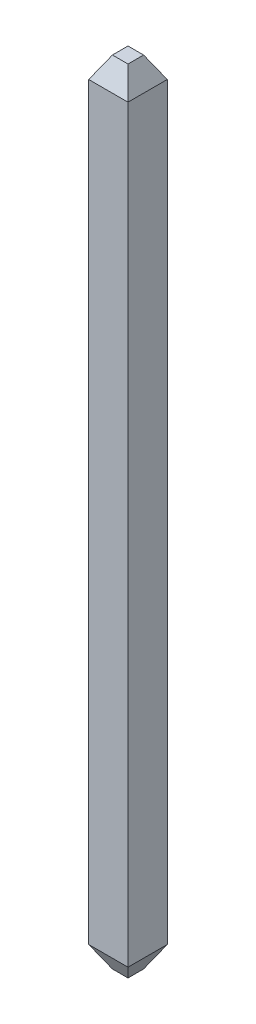
ISO-10303-21;
HEADER;
FILE_DESCRIPTION(('STEP AP214'),'2;1');
FILE_NAME('part.step','',(''),(''),'','','');
FILE_SCHEMA(('AUTOMOTIVE_DESIGN { 1 0 10303 214 1 1 1 1 }'));
ENDSEC;
DATA;
#1=APPLICATION_CONTEXT('core data for automotive mechanical design processes');
#2=APPLICATION_PROTOCOL_DEFINITION('international standard','automotive_design',2000,#1);
#3=PRODUCT_CONTEXT('',#1,'mechanical');
#4=PRODUCT('Part','Part','',(#3));
#5=PRODUCT_RELATED_PRODUCT_CATEGORY('part','',(#4));
#6=PRODUCT_DEFINITION_FORMATION('','',#4);
#7=PRODUCT_DEFINITION_CONTEXT('part definition',#1,'design');
#8=PRODUCT_DEFINITION('design','',#6,#7);
#9=PRODUCT_DEFINITION_SHAPE('','',#8);
#10=(LENGTH_UNIT() NAMED_UNIT(*) SI_UNIT(.MILLI.,.METRE.));
#11=(NAMED_UNIT(*) PLANE_ANGLE_UNIT() SI_UNIT($,.RADIAN.));
#12=(NAMED_UNIT(*) SI_UNIT($,.STERADIAN.) SOLID_ANGLE_UNIT());
#13=UNCERTAINTY_MEASURE_WITH_UNIT(LENGTH_MEASURE(1.E-05),#10,'distance_accuracy_value','');
#14=(GEOMETRIC_REPRESENTATION_CONTEXT(3) GLOBAL_UNCERTAINTY_ASSIGNED_CONTEXT((#13)) GLOBAL_UNIT_ASSIGNED_CONTEXT((#10,
#11,#12)) REPRESENTATION_CONTEXT('',''));
#15=CARTESIAN_POINT('',(0.,0.,0.));
#16=DIRECTION('',(0.,0.,1.));
#17=DIRECTION('',(1.,0.,0.));
#18=AXIS2_PLACEMENT_3D('',#15,#16,#17);
#19=CARTESIAN_POINT('',(0.497289871213,-21.22226807941,4.789039407632));
#20=DIRECTION('',(0.,0.488489958076213,0.87256951634738));
#21=DIRECTION('',(0.,-0.87256951634738,0.488489958076213));
#22=AXIS2_PLACEMENT_3D('',#19,#20,#21);
#23=PLANE('',#22);
#24=DIRECTION('',(1.,0.,0.));
#25=VECTOR('',#24,1.);
#26=CARTESIAN_POINT('',(0.497289871213,-21.57099360271,4.98426616385793));
#27=LINE('',#26,#25);
#28=CARTESIAN_POINT('',(0.48728989589798,-21.5709939289416,4.98426616384538));
#29=VERTEX_POINT('',#28);
#30=CARTESIAN_POINT('',(-0.142710289145667,-21.5709938896675,4.98426632450452));
#31=VERTEX_POINT('',#30);
#32=EDGE_CURVE('E118',#29,#31,#27,.F.);
#33=ORIENTED_EDGE('',*,*,#32,.F.);
#34=DIRECTION('',(0.438284036988266,-0.784297353956641,0.439072617567845));
#35=VECTOR('',#34,1.);
#36=CARTESIAN_POINT('',(0.29728987121219,-21.2309937745705,4.793924307213));
#37=LINE('',#36,#35);
#38=CARTESIAN_POINT('',(0.297289871212797,-21.2309937745703,4.79392430721258));
#39=VERTEX_POINT('',#38);
#40=EDGE_CURVE('E116',#39,#29,#37,.T.);
#41=ORIENTED_EDGE('',*,*,#40,.F.);
#42=DIRECTION('',(-1.,0.,0.));
#43=VECTOR('',#42,1.);
#44=CARTESIAN_POINT('',(0.307289871213,-21.23099377457,4.793924307213));
#45=LINE('',#44,#43);
#46=CARTESIAN_POINT('',(0.0472898712130297,-21.2309937745702,4.79392430721258));
#47=VERTEX_POINT('',#46);
#48=EDGE_CURVE('E79',#47,#39,#45,.F.);
#49=ORIENTED_EDGE('',*,*,#48,.F.);
#50=DIRECTION('',(0.438284036988272,0.784297353956654,-0.439072617567817));
#51=VECTOR('',#50,1.);
#52=CARTESIAN_POINT('',(-0.14271012878781,-21.5709936027095,4.984266163858));
#53=LINE('',#52,#51);
#54=EDGE_CURVE('E110',#31,#47,#53,.T.);
#55=ORIENTED_EDGE('',*,*,#54,.F.);
#56=EDGE_LOOP('',(#33,#41,#49,#55));
#57=FACE_BOUND('',#56,.T.);
#58=ADVANCED_FACE('F17',(#57),#23,.T.);
#59=CARTESIAN_POINT('',(0.497289871213,-33.93541112064,4.789291335356));
#60=DIRECTION('',(0.,-0.487152273933216,0.873317045523387));
#61=DIRECTION('',(0.,-0.873317045523387,-0.487152273933216));
#62=AXIS2_PLACEMENT_3D('',#59,#60,#61);
#63=PLANE('',#62);
#64=DIRECTION('',(-0.438586917260297,-0.784839349958943,-0.437799852403052));
#65=VECTOR('',#64,1.);
#66=CARTESIAN_POINT('',(0.487290184384019,-33.5866775616409,4.983822206765));
#67=LINE('',#66,#65);
#68=CARTESIAN_POINT('',(0.487289980136551,-33.5866774630266,4.98382196176172));
#69=VERTEX_POINT('',#68);
#70=CARTESIAN_POINT('',(0.29728987121302,-33.9266779501895,4.79416285809401));
#71=VERTEX_POINT('',#70);
#72=EDGE_CURVE('E122',#69,#71,#67,.T.);
#73=ORIENTED_EDGE('',*,*,#72,.F.);
#74=DIRECTION('',(1.,0.,0.));
#75=VECTOR('',#74,1.);
#76=CARTESIAN_POINT('',(0.497289871213,-33.5866774970136,4.98382284621967));
#77=LINE('',#76,#75);
#78=CARTESIAN_POINT('',(-0.142710305819022,-33.5866774872793,4.98382196001637));
#79=VERTEX_POINT('',#78);
#80=EDGE_CURVE('E89',#79,#69,#77,.T.);
#81=ORIENTED_EDGE('',*,*,#80,.F.);
#82=DIRECTION('',(-0.438586917260198,0.784839349958761,0.437799852403477));
#83=VECTOR('',#82,1.);
#84=CARTESIAN_POINT('',(0.0472898712136261,-33.9266779501897,4.794162858095));
#85=LINE('',#84,#83);
#86=CARTESIAN_POINT('',(0.0472898712132013,-33.9266779501894,4.79416285809401));
#87=VERTEX_POINT('',#86);
#88=EDGE_CURVE('E84',#87,#79,#85,.T.);
#89=ORIENTED_EDGE('',*,*,#88,.F.);
#90=DIRECTION('',(1.,0.,0.));
#91=VECTOR('',#90,1.);
#92=CARTESIAN_POINT('',(0.03728987121306,-33.92667795019,4.794162858095));
#93=LINE('',#92,#91);
#94=EDGE_CURVE('E20',#71,#87,#93,.F.);
#95=ORIENTED_EDGE('',*,*,#94,.F.);
#96=EDGE_LOOP('',(#73,#81,#89,#95));
#97=FACE_BOUND('',#96,.T.);
#98=ADVANCED_FACE('F86',(#97),#63,.T.);
#99=CARTESIAN_POINT('',(0.03728987121306,-33.92667795019,4.534162858095));
#100=DIRECTION('',(0.,-1.,0.));
#101=DIRECTION('',(1.,0.,0.));
#102=AXIS2_PLACEMENT_3D('',#99,#100,#101);
#103=PLANE('',#102);
#104=DIRECTION('',(0.,0.,1.));
#105=VECTOR('',#104,1.);
#106=CARTESIAN_POINT('',(0.0472898712136262,-33.9266779501897,4.343821001451));
#107=LINE('',#106,#105);
#108=CARTESIAN_POINT('',(0.0472898712133431,-33.9266779501896,4.54416285809542));
#109=VERTEX_POINT('',#108);
#110=EDGE_CURVE('E93',#109,#87,#107,.T.);
#111=ORIENTED_EDGE('',*,*,#110,.F.);
#112=DIRECTION('',(1.,0.,0.));
#113=VECTOR('',#112,1.);
#114=CARTESIAN_POINT('',(0.497289871213,-33.9266779501891,4.54416285809666));
#115=LINE('',#114,#113);
#116=CARTESIAN_POINT('',(0.29728987121304,-33.9266779501898,4.54416285809542));
#117=VERTEX_POINT('',#116);
#118=EDGE_CURVE('E129',#117,#109,#115,.F.);
#119=ORIENTED_EDGE('',*,*,#118,.F.);
#120=DIRECTION('',(0.,0.,1.));
#121=VECTOR('',#120,1.);
#122=CARTESIAN_POINT('',(0.297289871213079,-33.92667795019,4.343821001451));
#123=LINE('',#122,#121);
#124=EDGE_CURVE('E98',#71,#117,#123,.F.);
#125=ORIENTED_EDGE('',*,*,#124,.F.);
#126=ORIENTED_EDGE('',*,*,#94,.T.);
#127=EDGE_LOOP('',(#111,#119,#125,#126));
#128=FACE_BOUND('',#127,.T.);
#129=ADVANCED_FACE('F95',(#128),#103,.T.);
#130=CARTESIAN_POINT('',(0.05216808666874,-33.93540738396,4.343821001451));
#131=DIRECTION('',(-0.872943377132686,-0.487821545567825,0.));
#132=DIRECTION('',(0.487821545567825,-0.872943377132686,0.));
#133=AXIS2_PLACEMENT_3D('',#130,#131,#132);
#134=PLANE('',#133);
#135=DIRECTION('',(-0.43828470044216,0.784297071672232,-0.439072459537932));
#136=VECTOR('',#135,1.);
#137=CARTESIAN_POINT('',(0.04728987121306,-33.9266779501891,4.54416285809666));
#138=LINE('',#137,#136);
#139=CARTESIAN_POINT('',(-0.142710211258918,-33.5866782459584,4.35382181091626));
#140=VERTEX_POINT('',#139);
#141=EDGE_CURVE('E102',#109,#140,#138,.T.);
#142=ORIENTED_EDGE('',*,*,#141,.F.);
#143=ORIENTED_EDGE('',*,*,#110,.T.);
#144=ORIENTED_EDGE('',*,*,#88,.T.);
#145=DIRECTION('',(0.,0.,1.));
#146=VECTOR('',#145,1.);
#147=CARTESIAN_POINT('',(-0.142710128787,-33.58667874778,4.668990896586));
#148=LINE('',#147,#146);
#149=EDGE_CURVE('E131',#140,#79,#148,.T.);
#150=ORIENTED_EDGE('',*,*,#149,.F.);
#151=EDGE_LOOP('',(#142,#143,#144,#150));
#152=FACE_BOUND('',#151,.T.);
#153=ADVANCED_FACE('F100',(#152),#134,.T.);
#154=CARTESIAN_POINT('',(0.307289871213,-21.23099377457,4.533924307213));
#155=DIRECTION('',(0.,1.,0.));
#156=DIRECTION('',(-1.,0.,0.));
#157=AXIS2_PLACEMENT_3D('',#154,#155,#156);
#158=PLANE('',#157);
#159=ORIENTED_EDGE('',*,*,#48,.T.);
#160=DIRECTION('',(0.,0.,1.));
#161=VECTOR('',#160,1.);
#162=CARTESIAN_POINT('',(0.29728987121219,-21.2309937745705,4.344266163858));
#163=LINE('',#162,#161);
#164=CARTESIAN_POINT('',(0.297289871212798,-21.2309937745704,4.54392430721349));
#165=VERTEX_POINT('',#164);
#166=EDGE_CURVE('E113',#165,#39,#163,.T.);
#167=ORIENTED_EDGE('',*,*,#166,.F.);
#168=DIRECTION('',(1.,0.,0.));
#169=VECTOR('',#168,1.);
#170=CARTESIAN_POINT('',(0.497289871213,-21.2309937745711,4.54392430721497));
#171=LINE('',#170,#169);
#172=CARTESIAN_POINT('',(0.0472898712130297,-21.2309937745703,4.54392430721349));
#173=VERTEX_POINT('',#172);
#174=EDGE_CURVE('E140',#173,#165,#171,.T.);
#175=ORIENTED_EDGE('',*,*,#174,.F.);
#176=DIRECTION('',(0.,0.,1.));
#177=VECTOR('',#176,1.);
#178=CARTESIAN_POINT('',(0.0472898712129385,-21.2309937745699,4.344266163858));
#179=LINE('',#178,#177);
#180=EDGE_CURVE('E105',#47,#173,#179,.F.);
#181=ORIENTED_EDGE('',*,*,#180,.F.);
#182=EDGE_LOOP('',(#159,#167,#175,#181));
#183=FACE_BOUND('',#182,.T.);
#184=ADVANCED_FACE('F184',(#183),#158,.T.);
#185=CARTESIAN_POINT('',(-0.147588344243,-21.57972303648,4.344266163858));
#186=DIRECTION('',(-0.872943377132686,0.487821545567825,0.));
#187=DIRECTION('',(-0.487821545567825,-0.872943377132686,0.));
#188=AXIS2_PLACEMENT_3D('',#185,#186,#187);
#189=PLANE('',#188);
#190=DIRECTION('',(0.,0.,1.));
#191=VECTOR('',#190,1.);
#192=CARTESIAN_POINT('',(-0.142710128787008,-21.57099360271,4.668990896586));
#193=LINE('',#192,#191);
#194=CARTESIAN_POINT('',(-0.142710835596165,-21.5709953440113,4.35426575489926));
#195=VERTEX_POINT('',#194);
#196=EDGE_CURVE('E137',#31,#195,#193,.F.);
#197=ORIENTED_EDGE('',*,*,#196,.F.);
#198=ORIENTED_EDGE('',*,*,#54,.T.);
#199=ORIENTED_EDGE('',*,*,#180,.T.);
#200=DIRECTION('',(0.438586429090246,0.784840434712884,0.437798396819311));
#201=VECTOR('',#200,1.);
#202=CARTESIAN_POINT('',(-0.142710849418,-21.5709957406264,4.35426497129039));
#203=LINE('',#202,#201);
#204=EDGE_CURVE('E145',#195,#173,#203,.T.);
#205=ORIENTED_EDGE('',*,*,#204,.F.);
#206=EDGE_LOOP('',(#197,#198,#199,#205));
#207=FACE_BOUND('',#206,.T.);
#208=ADVANCED_FACE('F182',(#207),#189,.T.);
#209=CARTESIAN_POINT('',(0.292411655757,-21.2222643408,4.344266163858));
#210=DIRECTION('',(0.872943377132686,0.487821545567825,0.));
#211=DIRECTION('',(-0.487821545567825,0.872943377132686,0.));
#212=AXIS2_PLACEMENT_3D('',#209,#210,#211);
#213=PLANE('',#212);
#214=ORIENTED_EDGE('',*,*,#166,.T.);
#215=ORIENTED_EDGE('',*,*,#40,.T.);
#216=DIRECTION('',(0.,0.,1.));
#217=VECTOR('',#216,1.);
#218=CARTESIAN_POINT('',(0.487289871212996,-21.57099621256,4.343872654069));
#219=LINE('',#218,#217);
#220=CARTESIAN_POINT('',(0.487290141449586,-21.5709947896532,4.35426628939785));
#221=VERTEX_POINT('',#220);
#222=EDGE_CURVE('E35',#221,#29,#219,.T.);
#223=ORIENTED_EDGE('',*,*,#222,.F.);
#224=DIRECTION('',(0.438586429090131,-0.784840434712933,-0.437798396819336));
#225=VECTOR('',#224,1.);
#226=CARTESIAN_POINT('',(0.297289871213,-21.2309937745711,4.54392430721497));
#227=LINE('',#226,#225);
#228=EDGE_CURVE('E143',#165,#221,#227,.T.);
#229=ORIENTED_EDGE('',*,*,#228,.F.);
#230=EDGE_LOOP('',(#214,#215,#223,#229));
#231=FACE_BOUND('',#230,.T.);
#232=ADVANCED_FACE('F185',(#231),#213,.T.);
#233=CARTESIAN_POINT('',(0.497289871213,-21.45033675752,4.984270615482));
#234=DIRECTION('',(0.,-3.68949151673641E-05,0.999999999319383));
#235=DIRECTION('',(0.,-0.999999999319383,-3.68949151673641E-05));
#236=AXIS2_PLACEMENT_3D('',#233,#234,#235);
#237=PLANE('',#236);
#238=DIRECTION('',(0.,0.999999999317418,3.6948133506474E-05));
#239=VECTOR('',#238,1.);
#240=CARTESIAN_POINT('',(-0.142710128787,-33.58667749699,4.983822206765));
#241=LINE('',#240,#239);
#242=EDGE_CURVE('E134',#79,#31,#241,.T.);
#243=ORIENTED_EDGE('',*,*,#242,.F.);
#244=ORIENTED_EDGE('',*,*,#80,.T.);
#245=DIRECTION('',(0.,-0.999999999317418,-3.6948133506474E-05));
#246=VECTOR('',#245,1.);
#247=CARTESIAN_POINT('',(0.487289871212996,-21.57099360271,4.984266163858));
#248=LINE('',#247,#246);
#249=EDGE_CURVE('E149',#29,#69,#248,.T.);
#250=ORIENTED_EDGE('',*,*,#249,.F.);
#251=ORIENTED_EDGE('',*,*,#32,.T.);
#252=EDGE_LOOP('',(#243,#244,#250,#251));
#253=FACE_BOUND('',#252,.T.);
#254=ADVANCED_FACE('F187',(#253),#237,.T.);
#255=CARTESIAN_POINT('',(0.492168086669,-33.57794868828,4.343821001451));
#256=DIRECTION('',(0.872943377132686,-0.487821545567825,0.));
#257=DIRECTION('',(0.487821545567825,0.872943377132686,0.));
#258=AXIS2_PLACEMENT_3D('',#255,#256,#257);
#259=PLANE('',#258);
#260=ORIENTED_EDGE('',*,*,#124,.T.);
#261=DIRECTION('',(-0.438284700442048,-0.78429707167228,0.439072459537957));
#262=VECTOR('',#261,1.);
#263=CARTESIAN_POINT('',(0.487289673578,-33.5866791127601,4.35382155607999));
#264=LINE('',#263,#262);
#265=CARTESIAN_POINT('',(0.487289755137329,-33.5866786503075,4.35382212481551));
#266=VERTEX_POINT('',#265);
#267=EDGE_CURVE('E126',#266,#117,#264,.T.);
#268=ORIENTED_EDGE('',*,*,#267,.F.);
#269=DIRECTION('',(0.,0.,1.));
#270=VECTOR('',#269,1.);
#271=CARTESIAN_POINT('',(0.487289871213004,-33.58667749699,4.343872654069));
#272=LINE('',#271,#270);
#273=EDGE_CURVE('E152',#69,#266,#272,.F.);
#274=ORIENTED_EDGE('',*,*,#273,.F.);
#275=ORIENTED_EDGE('',*,*,#72,.T.);
#276=EDGE_LOOP('',(#260,#268,#274,#275));
#277=FACE_BOUND('',#276,.T.);
#278=ADVANCED_FACE('F174',(#277),#259,.T.);
#279=CARTESIAN_POINT('',(0.497289871213,-33.93540364535,4.549047757676));
#280=DIRECTION('',(0.,-0.488489958076213,-0.87256951634738));
#281=DIRECTION('',(0.,0.87256951634738,-0.488489958076213));
#282=AXIS2_PLACEMENT_3D('',#279,#280,#281);
#283=PLANE('',#282);
#284=ORIENTED_EDGE('',*,*,#267,.T.);
#285=ORIENTED_EDGE('',*,*,#118,.T.);
#286=ORIENTED_EDGE('',*,*,#141,.T.);
#287=DIRECTION('',(1.,0.,0.));
#288=VECTOR('',#287,1.);
#289=CARTESIAN_POINT('',(0.497289871213,-33.5866787478035,4.3538228461729));
#290=LINE('',#289,#288);
#291=EDGE_CURVE('E155',#266,#140,#290,.F.);
#292=ORIENTED_EDGE('',*,*,#291,.F.);
#293=EDGE_LOOP('',(#284,#285,#286,#292));
#294=FACE_BOUND('',#293,.T.);
#295=ADVANCED_FACE('F177',(#294),#283,.T.);
#296=CARTESIAN_POINT('',(-0.142710128787,-33.75733847732,4.668990896586));
#297=DIRECTION('',(-1.,0.,0.));
#298=DIRECTION('',(0.,-1.,0.));
#299=AXIS2_PLACEMENT_3D('',#296,#297,#298);
#300=PLANE('',#299);
#301=ORIENTED_EDGE('',*,*,#196,.T.);
#302=DIRECTION('',(0.,0.999999999319383,3.68949151676141E-05));
#303=VECTOR('',#302,1.);
#304=CARTESIAN_POINT('',(-0.142709931152,-33.75734199129,4.353816549567));
#305=LINE('',#304,#303);
#306=EDGE_CURVE('E158',#140,#195,#305,.T.);
#307=ORIENTED_EDGE('',*,*,#306,.F.);
#308=ORIENTED_EDGE('',*,*,#149,.T.);
#309=ORIENTED_EDGE('',*,*,#242,.T.);
#310=EDGE_LOOP('',(#301,#307,#308,#309));
#311=FACE_BOUND('',#310,.T.);
#312=ADVANCED_FACE('F179',(#311),#300,.T.);
#313=CARTESIAN_POINT('',(0.497289871213,-21.22226060412,4.548795829952));
#314=DIRECTION('',(0.,0.487152273933216,-0.873317045523387));
#315=DIRECTION('',(0.,0.873317045523387,0.487152273933216));
#316=AXIS2_PLACEMENT_3D('',#313,#314,#315);
#317=PLANE('',#316);
#318=DIRECTION('',(1.,0.,0.));
#319=VECTOR('',#318,1.);
#320=CARTESIAN_POINT('',(0.497289871213,-21.5709962125728,4.35426616376102));
#321=LINE('',#320,#319);
#322=EDGE_CURVE('E26',#195,#221,#321,.T.);
#323=ORIENTED_EDGE('',*,*,#322,.F.);
#324=ORIENTED_EDGE('',*,*,#204,.T.);
#325=ORIENTED_EDGE('',*,*,#174,.T.);
#326=ORIENTED_EDGE('',*,*,#228,.T.);
#327=EDGE_LOOP('',(#323,#324,#325,#326));
#328=FACE_BOUND('',#327,.T.);
#329=ADVANCED_FACE('F168',(#328),#317,.T.);
#330=CARTESIAN_POINT('',(0.487289871213,-27.60384299983,4.343872654069));
#331=DIRECTION('',(1.,0.,0.));
#332=DIRECTION('',(0.,1.,0.));
#333=AXIS2_PLACEMENT_3D('',#330,#331,#332);
#334=PLANE('',#333);
#335=ORIENTED_EDGE('',*,*,#249,.T.);
#336=ORIENTED_EDGE('',*,*,#273,.T.);
#337=DIRECTION('',(0.,0.999999999319383,3.68949151676141E-05));
#338=VECTOR('',#337,1.);
#339=CARTESIAN_POINT('',(0.487290591844,-33.75734199129,4.353816549567));
#340=LINE('',#339,#338);
#341=EDGE_CURVE('E11',#221,#266,#340,.F.);
#342=ORIENTED_EDGE('',*,*,#341,.F.);
#343=ORIENTED_EDGE('',*,*,#222,.T.);
#344=EDGE_LOOP('',(#335,#336,#342,#343));
#345=FACE_BOUND('',#344,.T.);
#346=ADVANCED_FACE('F170',(#345),#334,.T.);
#347=CARTESIAN_POINT('',(0.497289871213,-33.75734199129,4.353816549567));
#348=DIRECTION('',(0.,3.68949151676141E-05,-0.999999999319383));
#349=DIRECTION('',(0.,0.999999999319383,3.68949151676141E-05));
#350=AXIS2_PLACEMENT_3D('',#347,#348,#349);
#351=PLANE('',#350);
#352=ORIENTED_EDGE('',*,*,#322,.T.);
#353=ORIENTED_EDGE('',*,*,#341,.T.);
#354=ORIENTED_EDGE('',*,*,#291,.T.);
#355=ORIENTED_EDGE('',*,*,#306,.T.);
#356=EDGE_LOOP('',(#352,#353,#354,#355));
#357=FACE_BOUND('',#356,.T.);
#358=ADVANCED_FACE('F164',(#357),#351,.T.);
#359=CLOSED_SHELL('',(#58,#98,#129,#153,#184,#208,#232,#254,#278,#295,#312,#329,#346,#358));
#360=MANIFOLD_SOLID_BREP('B1',#359);
#361=ADVANCED_BREP_SHAPE_REPRESENTATION('',(#18,#360),#14);
#362=SHAPE_DEFINITION_REPRESENTATION(#9,#361);
ENDSEC;
END-ISO-10303-21;
